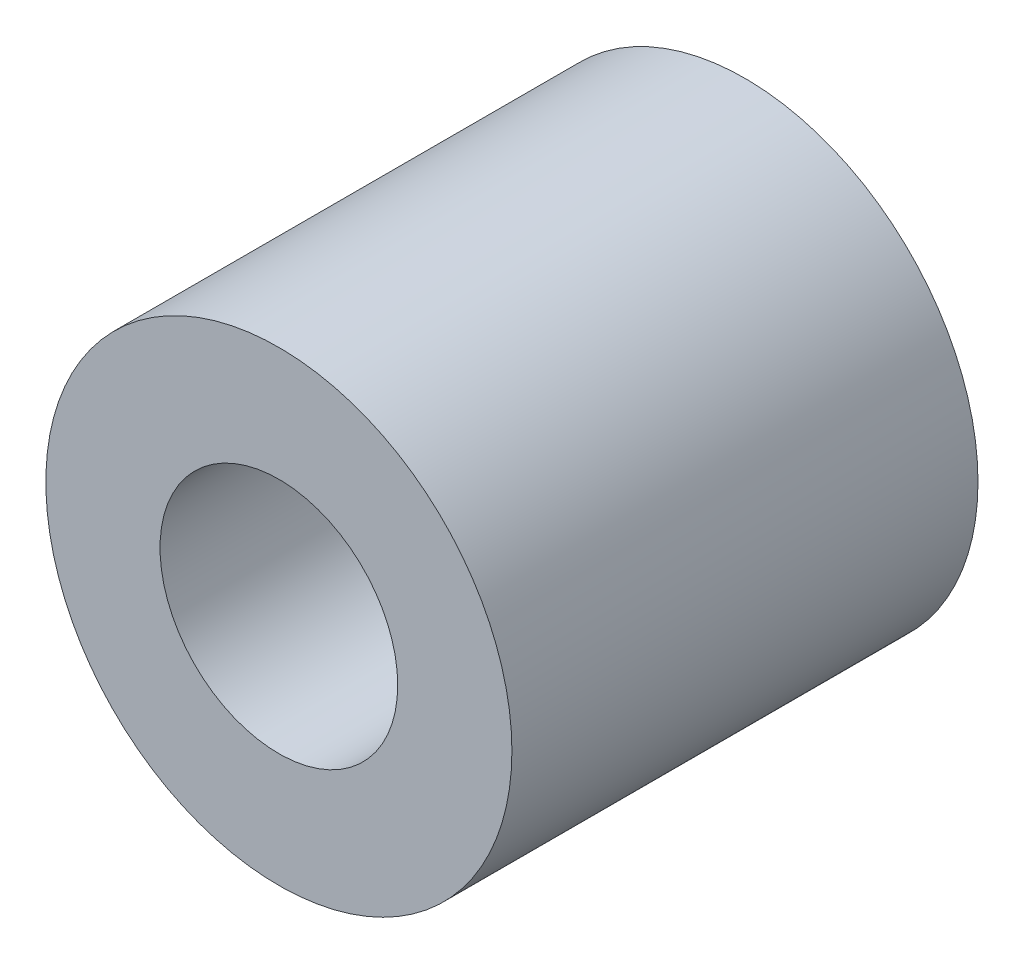
ISO-10303-21;
HEADER;
FILE_DESCRIPTION(('STEP AP214'),'2;1');
FILE_NAME('part.step','',(''),(''),'','','');
FILE_SCHEMA(('AUTOMOTIVE_DESIGN { 1 0 10303 214 1 1 1 1 }'));
ENDSEC;
DATA;
#1=APPLICATION_CONTEXT('core data for automotive mechanical design processes');
#2=APPLICATION_PROTOCOL_DEFINITION('international standard','automotive_design',2000,#1);
#3=PRODUCT_CONTEXT('',#1,'mechanical');
#4=PRODUCT('Part','Part','',(#3));
#5=PRODUCT_RELATED_PRODUCT_CATEGORY('part','',(#4));
#6=PRODUCT_DEFINITION_FORMATION('','',#4);
#7=PRODUCT_DEFINITION_CONTEXT('part definition',#1,'design');
#8=PRODUCT_DEFINITION('design','',#6,#7);
#9=PRODUCT_DEFINITION_SHAPE('','',#8);
#10=(LENGTH_UNIT() NAMED_UNIT(*) SI_UNIT(.MILLI.,.METRE.));
#11=(NAMED_UNIT(*) PLANE_ANGLE_UNIT() SI_UNIT($,.RADIAN.));
#12=(NAMED_UNIT(*) SI_UNIT($,.STERADIAN.) SOLID_ANGLE_UNIT());
#13=UNCERTAINTY_MEASURE_WITH_UNIT(LENGTH_MEASURE(1.E-05),#10,'distance_accuracy_value','');
#14=(GEOMETRIC_REPRESENTATION_CONTEXT(3) GLOBAL_UNCERTAINTY_ASSIGNED_CONTEXT((#13)) GLOBAL_UNIT_ASSIGNED_CONTEXT((#10,
#11,#12)) REPRESENTATION_CONTEXT('',''));
#15=CARTESIAN_POINT('',(0.,0.,0.));
#16=DIRECTION('',(0.,0.,1.));
#17=DIRECTION('',(1.,0.,0.));
#18=AXIS2_PLACEMENT_3D('',#15,#16,#17);
#19=CARTESIAN_POINT('',(0.,0.,12.7));
#20=DIRECTION('',(0.,0.,1.));
#21=DIRECTION('',(1.,0.,0.));
#22=AXIS2_PLACEMENT_3D('',#19,#20,#21);
#23=PLANE('',#22);
#24=CARTESIAN_POINT('',(0.,0.,12.7));
#25=DIRECTION('',(0.,0.,1.));
#26=DIRECTION('',(1.,0.,0.));
#27=AXIS2_PLACEMENT_3D('',#24,#25,#26);
#28=CIRCLE('',#27,12.7);
#29=CARTESIAN_POINT('',(12.7,0.,12.7));
#30=VERTEX_POINT('',#29);
#31=EDGE_CURVE('E10',#30,#30,#28,.T.);
#32=ORIENTED_EDGE('',*,*,#31,.T.);
#33=EDGE_LOOP('',(#32));
#34=FACE_BOUND('',#33,.T.);
#35=CARTESIAN_POINT('',(0.,0.,12.7));
#36=DIRECTION('',(0.,0.,1.));
#37=DIRECTION('',(1.,0.,0.));
#38=AXIS2_PLACEMENT_3D('',#35,#36,#37);
#39=CIRCLE('',#38,6.477);
#40=CARTESIAN_POINT('',(6.477,0.,12.7));
#41=VERTEX_POINT('',#40);
#42=EDGE_CURVE('E39',#41,#41,#39,.T.);
#43=ORIENTED_EDGE('',*,*,#42,.F.);
#44=EDGE_LOOP('',(#43));
#45=FACE_BOUND('',#44,.T.);
#46=ADVANCED_FACE('F32',(#34,#45),#23,.T.);
#47=CARTESIAN_POINT('',(0.,0.,12.7));
#48=DIRECTION('',(0.,0.,-1.));
#49=DIRECTION('',(-1.,0.,0.));
#50=AXIS2_PLACEMENT_3D('',#47,#48,#49);
#51=CYLINDRICAL_SURFACE('',#50,12.7);
#52=ORIENTED_EDGE('',*,*,#31,.F.);
#53=EDGE_LOOP('',(#52));
#54=FACE_BOUND('',#53,.T.);
#55=CARTESIAN_POINT('',(0.,0.,-12.7));
#56=DIRECTION('',(0.,0.,1.));
#57=DIRECTION('',(1.,0.,0.));
#58=AXIS2_PLACEMENT_3D('',#55,#56,#57);
#59=CIRCLE('',#58,12.7);
#60=CARTESIAN_POINT('',(12.7,0.,-12.7));
#61=VERTEX_POINT('',#60);
#62=EDGE_CURVE('E43',#61,#61,#59,.T.);
#63=ORIENTED_EDGE('',*,*,#62,.T.);
#64=EDGE_LOOP('',(#63));
#65=FACE_BOUND('',#64,.T.);
#66=ADVANCED_FACE('F34',(#54,#65),#51,.T.);
#67=CARTESIAN_POINT('',(0.,0.,12.7));
#68=DIRECTION('',(0.,0.,-1.));
#69=DIRECTION('',(-1.,0.,0.));
#70=AXIS2_PLACEMENT_3D('',#67,#68,#69);
#71=CYLINDRICAL_SURFACE('',#70,6.477);
#72=ORIENTED_EDGE('',*,*,#42,.T.);
#73=EDGE_LOOP('',(#72));
#74=FACE_BOUND('',#73,.T.);
#75=CARTESIAN_POINT('',(0.,0.,-12.7));
#76=DIRECTION('',(0.,0.,1.));
#77=DIRECTION('',(1.,0.,0.));
#78=AXIS2_PLACEMENT_3D('',#75,#76,#77);
#79=CIRCLE('',#78,6.477);
#80=CARTESIAN_POINT('',(6.477,0.,-12.7));
#81=VERTEX_POINT('',#80);
#82=EDGE_CURVE('E47',#81,#81,#79,.T.);
#83=ORIENTED_EDGE('',*,*,#82,.F.);
#84=EDGE_LOOP('',(#83));
#85=FACE_BOUND('',#84,.T.);
#86=ADVANCED_FACE('F56',(#74,#85),#71,.F.);
#87=CARTESIAN_POINT('',(0.,0.,-12.7));
#88=DIRECTION('',(0.,0.,1.));
#89=DIRECTION('',(1.,0.,0.));
#90=AXIS2_PLACEMENT_3D('',#87,#88,#89);
#91=PLANE('',#90);
#92=ORIENTED_EDGE('',*,*,#82,.T.);
#93=EDGE_LOOP('',(#92));
#94=FACE_BOUND('',#93,.T.);
#95=ORIENTED_EDGE('',*,*,#62,.F.);
#96=EDGE_LOOP('',(#95));
#97=FACE_BOUND('',#96,.T.);
#98=ADVANCED_FACE('F53',(#94,#97),#91,.F.);
#99=CLOSED_SHELL('',(#46,#66,#86,#98));
#100=MANIFOLD_SOLID_BREP('B2',#99);
#101=ADVANCED_BREP_SHAPE_REPRESENTATION('',(#18,#100),#14);
#102=SHAPE_DEFINITION_REPRESENTATION(#9,#101);
ENDSEC;
END-ISO-10303-21;
